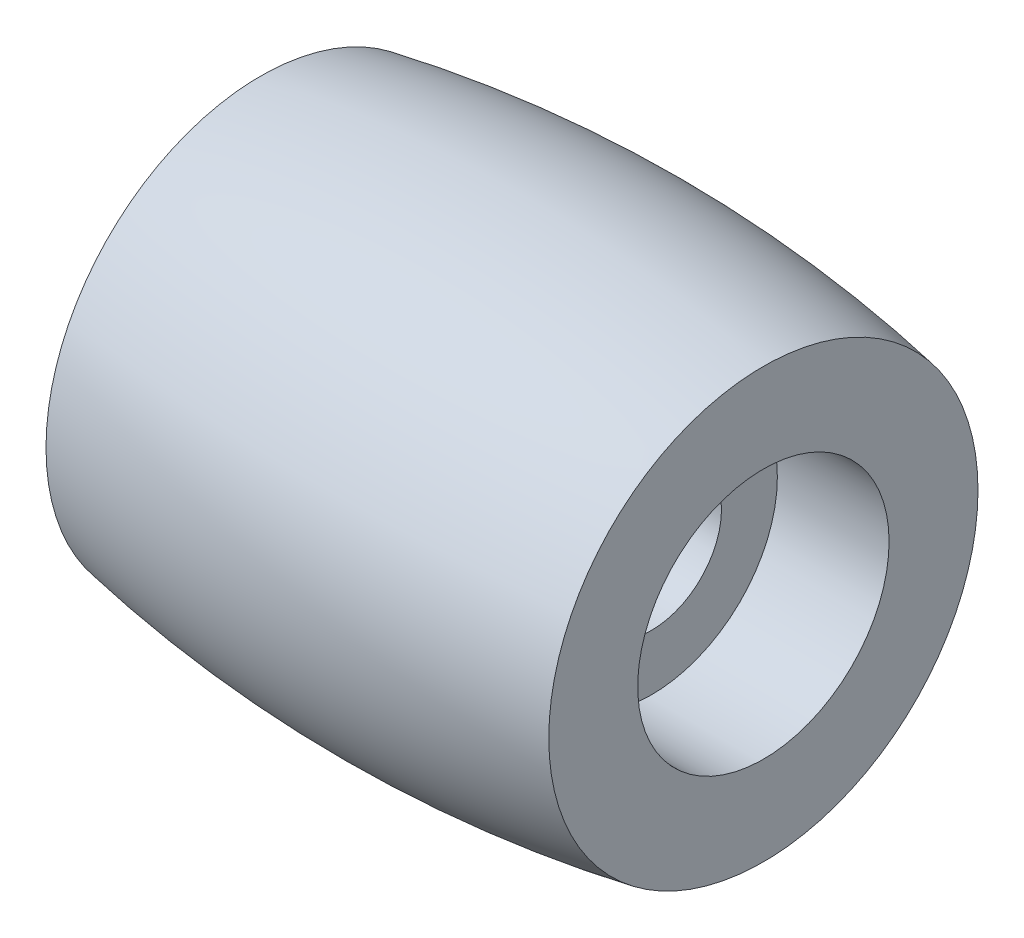
ISO-10303-21;
HEADER;
FILE_DESCRIPTION(('STEP AP214'),'2;1');
FILE_NAME('part.step','',(''),(''),'','','');
FILE_SCHEMA(('AUTOMOTIVE_DESIGN { 1 0 10303 214 1 1 1 1 }'));
ENDSEC;
DATA;
#1=APPLICATION_CONTEXT('core data for automotive mechanical design processes');
#2=APPLICATION_PROTOCOL_DEFINITION('international standard','automotive_design',2000,#1);
#3=PRODUCT_CONTEXT('',#1,'mechanical');
#4=PRODUCT('Part','Part','',(#3));
#5=PRODUCT_RELATED_PRODUCT_CATEGORY('part','',(#4));
#6=PRODUCT_DEFINITION_FORMATION('','',#4);
#7=PRODUCT_DEFINITION_CONTEXT('part definition',#1,'design');
#8=PRODUCT_DEFINITION('design','',#6,#7);
#9=PRODUCT_DEFINITION_SHAPE('','',#8);
#10=(LENGTH_UNIT() NAMED_UNIT(*) SI_UNIT(.MILLI.,.METRE.));
#11=(NAMED_UNIT(*) PLANE_ANGLE_UNIT() SI_UNIT($,.RADIAN.));
#12=(NAMED_UNIT(*) SI_UNIT($,.STERADIAN.) SOLID_ANGLE_UNIT());
#13=UNCERTAINTY_MEASURE_WITH_UNIT(LENGTH_MEASURE(1.E-05),#10,'distance_accuracy_value','');
#14=(GEOMETRIC_REPRESENTATION_CONTEXT(3) GLOBAL_UNCERTAINTY_ASSIGNED_CONTEXT((#13)) GLOBAL_UNIT_ASSIGNED_CONTEXT((#10,
#11,#12)) REPRESENTATION_CONTEXT('',''));
#15=CARTESIAN_POINT('',(0.,0.,0.));
#16=DIRECTION('',(0.,0.,1.));
#17=DIRECTION('',(1.,0.,0.));
#18=AXIS2_PLACEMENT_3D('',#15,#16,#17);
#19=CARTESIAN_POINT('',(-9.,0.,0.));
#20=DIRECTION('',(1.,0.,0.));
#21=DIRECTION('',(0.,0.,-1.));
#22=AXIS2_PLACEMENT_3D('',#19,#20,#21);
#23=CYLINDRICAL_SURFACE('',#22,2.5);
#24=CARTESIAN_POINT('',(5.,0.,0.));
#25=DIRECTION('',(1.,0.,0.));
#26=DIRECTION('',(0.,0.,-1.));
#27=AXIS2_PLACEMENT_3D('',#24,#25,#26);
#28=CIRCLE('',#27,2.5);
#29=CARTESIAN_POINT('',(5.,0.,-2.5));
#30=VERTEX_POINT('',#29);
#31=EDGE_CURVE('E47',#30,#30,#28,.F.);
#32=ORIENTED_EDGE('',*,*,#31,.F.);
#33=EDGE_LOOP('',(#32));
#34=FACE_BOUND('',#33,.T.);
#35=CARTESIAN_POINT('',(-5.,0.,0.));
#36=DIRECTION('',(-1.,0.,0.));
#37=DIRECTION('',(0.,0.,1.));
#38=AXIS2_PLACEMENT_3D('',#35,#36,#37);
#39=CIRCLE('',#38,2.5);
#40=CARTESIAN_POINT('',(-5.,0.,2.5));
#41=VERTEX_POINT('',#40);
#42=EDGE_CURVE('E38',#41,#41,#39,.F.);
#43=ORIENTED_EDGE('',*,*,#42,.F.);
#44=EDGE_LOOP('',(#43));
#45=FACE_BOUND('',#44,.T.);
#46=ADVANCED_FACE('F34',(#34,#45),#23,.F.);
#47=CARTESIAN_POINT('',(9.,0.,0.));
#48=DIRECTION('',(-1.,0.,0.));
#49=DIRECTION('',(0.,0.,1.));
#50=AXIS2_PLACEMENT_3D('',#47,#48,#49);
#51=PLANE('',#50);
#52=CARTESIAN_POINT('',(9.,0.,0.));
#53=DIRECTION('',(1.,0.,0.));
#54=DIRECTION('',(0.,0.,-1.));
#55=AXIS2_PLACEMENT_3D('',#52,#53,#54);
#56=CIRCLE('',#55,4.5);
#57=CARTESIAN_POINT('',(9.,0.,-4.5));
#58=VERTEX_POINT('',#57);
#59=EDGE_CURVE('E55',#58,#58,#56,.T.);
#60=ORIENTED_EDGE('',*,*,#59,.F.);
#61=EDGE_LOOP('',(#60));
#62=FACE_BOUND('',#61,.T.);
#63=CARTESIAN_POINT('',(9.,0.,0.));
#64=DIRECTION('',(-1.,0.,0.));
#65=DIRECTION('',(0.,0.,1.));
#66=AXIS2_PLACEMENT_3D('',#63,#64,#65);
#67=CIRCLE('',#66,7.68333050943175);
#68=CARTESIAN_POINT('',(9.,0.,7.68333050943175));
#69=VERTEX_POINT('',#68);
#70=EDGE_CURVE('E42',#69,#69,#67,.T.);
#71=ORIENTED_EDGE('',*,*,#70,.F.);
#72=EDGE_LOOP('',(#71));
#73=FACE_BOUND('',#72,.T.);
#74=ADVANCED_FACE('F36',(#62,#73),#51,.F.);
#75=CARTESIAN_POINT('',(-9.,0.,0.));
#76=DIRECTION('',(1.,0.,0.));
#77=DIRECTION('',(0.,0.,-1.));
#78=AXIS2_PLACEMENT_3D('',#75,#76,#77);
#79=PLANE('',#78);
#80=CARTESIAN_POINT('',(-9.,0.,0.));
#81=DIRECTION('',(1.,0.,0.));
#82=DIRECTION('',(0.,0.,-1.));
#83=AXIS2_PLACEMENT_3D('',#80,#81,#82);
#84=CIRCLE('',#83,4.5);
#85=CARTESIAN_POINT('',(-9.,0.,-4.5));
#86=VERTEX_POINT('',#85);
#87=EDGE_CURVE('E61',#86,#86,#84,.T.);
#88=ORIENTED_EDGE('',*,*,#87,.T.);
#89=EDGE_LOOP('',(#88));
#90=FACE_BOUND('',#89,.T.);
#91=CARTESIAN_POINT('',(-9.,0.,0.));
#92=DIRECTION('',(-1.,0.,0.));
#93=DIRECTION('',(0.,0.,1.));
#94=AXIS2_PLACEMENT_3D('',#91,#92,#93);
#95=CIRCLE('',#94,7.68333050943175);
#96=CARTESIAN_POINT('',(-9.,0.,7.68333050943175));
#97=VERTEX_POINT('',#96);
#98=EDGE_CURVE('E10',#97,#97,#95,.T.);
#99=ORIENTED_EDGE('',*,*,#98,.T.);
#100=EDGE_LOOP('',(#99));
#101=FACE_BOUND('',#100,.T.);
#102=ADVANCED_FACE('F79',(#90,#101),#79,.F.);
#103=CARTESIAN_POINT('',(0.,0.,0.));
#104=DIRECTION('',(-1.,0.,0.));
#105=DIRECTION('',(0.,0.,1.));
#106=AXIS2_PLACEMENT_3D('',#103,#104,#105);
#107=DEGENERATE_TOROIDAL_SURFACE('',#106,41.5,50.,.F.);
#108=ORIENTED_EDGE('',*,*,#98,.F.);
#109=EDGE_LOOP('',(#108));
#110=FACE_BOUND('',#109,.T.);
#111=ORIENTED_EDGE('',*,*,#70,.T.);
#112=EDGE_LOOP('',(#111));
#113=FACE_BOUND('',#112,.T.);
#114=ADVANCED_FACE('F85',(#110,#113),#107,.F.);
#115=CARTESIAN_POINT('',(5.,0.,0.));
#116=DIRECTION('',(1.,0.,0.));
#117=DIRECTION('',(0.,0.,-1.));
#118=AXIS2_PLACEMENT_3D('',#115,#116,#117);
#119=PLANE('',#118);
#120=CARTESIAN_POINT('',(5.,0.,0.));
#121=DIRECTION('',(1.,0.,0.));
#122=DIRECTION('',(0.,0.,-1.));
#123=AXIS2_PLACEMENT_3D('',#120,#121,#122);
#124=CIRCLE('',#123,4.5);
#125=CARTESIAN_POINT('',(5.,0.,-4.5));
#126=VERTEX_POINT('',#125);
#127=EDGE_CURVE('E51',#126,#126,#124,.T.);
#128=ORIENTED_EDGE('',*,*,#127,.T.);
#129=EDGE_LOOP('',(#128));
#130=FACE_BOUND('',#129,.T.);
#131=ORIENTED_EDGE('',*,*,#31,.T.);
#132=EDGE_LOOP('',(#131));
#133=FACE_BOUND('',#132,.T.);
#134=ADVANCED_FACE('F87',(#130,#133),#119,.T.);
#135=CARTESIAN_POINT('',(5.,0.,0.));
#136=DIRECTION('',(1.,0.,0.));
#137=DIRECTION('',(0.,0.,-1.));
#138=AXIS2_PLACEMENT_3D('',#135,#136,#137);
#139=CYLINDRICAL_SURFACE('',#138,4.5);
#140=ORIENTED_EDGE('',*,*,#127,.F.);
#141=EDGE_LOOP('',(#140));
#142=FACE_BOUND('',#141,.T.);
#143=ORIENTED_EDGE('',*,*,#59,.T.);
#144=EDGE_LOOP('',(#143));
#145=FACE_BOUND('',#144,.T.);
#146=ADVANCED_FACE('F83',(#142,#145),#139,.F.);
#147=CARTESIAN_POINT('',(-5.,0.,0.));
#148=DIRECTION('',(-1.,0.,0.));
#149=DIRECTION('',(0.,0.,-1.));
#150=AXIS2_PLACEMENT_3D('',#147,#148,#149);
#151=PLANE('',#150);
#152=CARTESIAN_POINT('',(-5.,0.,0.));
#153=DIRECTION('',(1.,0.,0.));
#154=DIRECTION('',(0.,0.,-1.));
#155=AXIS2_PLACEMENT_3D('',#152,#153,#154);
#156=CIRCLE('',#155,4.5);
#157=CARTESIAN_POINT('',(-5.,0.,-4.5));
#158=VERTEX_POINT('',#157);
#159=EDGE_CURVE('E64',#158,#158,#156,.T.);
#160=ORIENTED_EDGE('',*,*,#159,.F.);
#161=EDGE_LOOP('',(#160));
#162=FACE_BOUND('',#161,.T.);
#163=ORIENTED_EDGE('',*,*,#42,.T.);
#164=EDGE_LOOP('',(#163));
#165=FACE_BOUND('',#164,.T.);
#166=ADVANCED_FACE('F71',(#162,#165),#151,.T.);
#167=CARTESIAN_POINT('',(-5.,0.,0.));
#168=DIRECTION('',(-1.,0.,0.));
#169=DIRECTION('',(0.,0.,1.));
#170=AXIS2_PLACEMENT_3D('',#167,#168,#169);
#171=CYLINDRICAL_SURFACE('',#170,4.5);
#172=ORIENTED_EDGE('',*,*,#159,.T.);
#173=EDGE_LOOP('',(#172));
#174=FACE_BOUND('',#173,.T.);
#175=ORIENTED_EDGE('',*,*,#87,.F.);
#176=EDGE_LOOP('',(#175));
#177=FACE_BOUND('',#176,.T.);
#178=ADVANCED_FACE('F95',(#174,#177),#171,.F.);
#179=CLOSED_SHELL('',(#46,#74,#102,#114,#134,#146,#166,#178));
#180=MANIFOLD_SOLID_BREP('B2',#179);
#181=ADVANCED_BREP_SHAPE_REPRESENTATION('',(#18,#180),#14);
#182=SHAPE_DEFINITION_REPRESENTATION(#9,#181);
ENDSEC;
END-ISO-10303-21;
